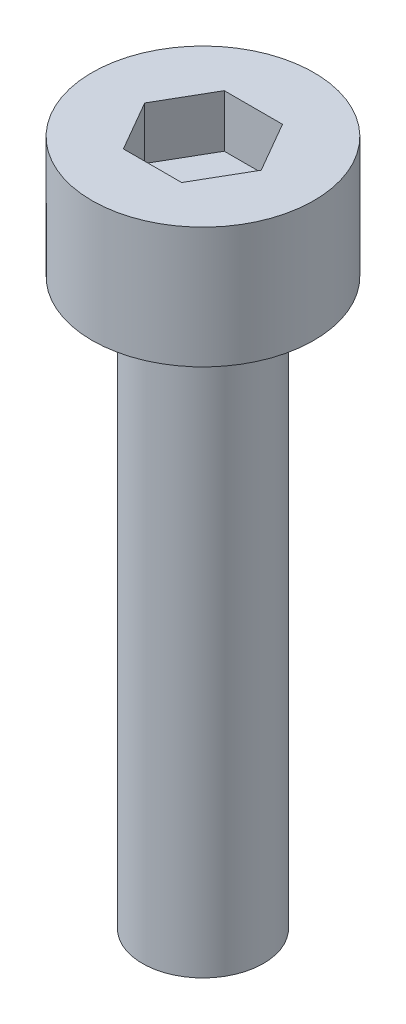
ISO-10303-21;
HEADER;
FILE_DESCRIPTION(('STEP AP214'),'2;1');
FILE_NAME('part.step','',(''),(''),'','','');
FILE_SCHEMA(('AUTOMOTIVE_DESIGN { 1 0 10303 214 1 1 1 1 }'));
ENDSEC;
DATA;
#1=APPLICATION_CONTEXT('core data for automotive mechanical design processes');
#2=APPLICATION_PROTOCOL_DEFINITION('international standard','automotive_design',2000,#1);
#3=PRODUCT_CONTEXT('',#1,'mechanical');
#4=PRODUCT('Part','Part','',(#3));
#5=PRODUCT_RELATED_PRODUCT_CATEGORY('part','',(#4));
#6=PRODUCT_DEFINITION_FORMATION('','',#4);
#7=PRODUCT_DEFINITION_CONTEXT('part definition',#1,'design');
#8=PRODUCT_DEFINITION('design','',#6,#7);
#9=PRODUCT_DEFINITION_SHAPE('','',#8);
#10=(LENGTH_UNIT() NAMED_UNIT(*) SI_UNIT(.MILLI.,.METRE.));
#11=(NAMED_UNIT(*) PLANE_ANGLE_UNIT() SI_UNIT($,.RADIAN.));
#12=(NAMED_UNIT(*) SI_UNIT($,.STERADIAN.) SOLID_ANGLE_UNIT());
#13=UNCERTAINTY_MEASURE_WITH_UNIT(LENGTH_MEASURE(1.E-05),#10,'distance_accuracy_value','');
#14=(GEOMETRIC_REPRESENTATION_CONTEXT(3) GLOBAL_UNCERTAINTY_ASSIGNED_CONTEXT((#13)) GLOBAL_UNIT_ASSIGNED_CONTEXT((#10,
#11,#12)) REPRESENTATION_CONTEXT('',''));
#15=CARTESIAN_POINT('',(0.,0.,0.));
#16=DIRECTION('',(0.,0.,1.));
#17=DIRECTION('',(1.,0.,0.));
#18=AXIS2_PLACEMENT_3D('',#15,#16,#17);
#19=CARTESIAN_POINT('',(0.,3.,0.));
#20=DIRECTION('',(0.,-1.,0.));
#21=DIRECTION('',(0.,0.,-1.));
#22=AXIS2_PLACEMENT_3D('',#19,#20,#21);
#23=CYLINDRICAL_SURFACE('',#22,2.75);
#24=CARTESIAN_POINT('',(0.,3.,0.));
#25=DIRECTION('',(0.,1.,0.));
#26=DIRECTION('',(0.,0.,1.));
#27=AXIS2_PLACEMENT_3D('',#24,#25,#26);
#28=CIRCLE('',#27,2.75);
#29=CARTESIAN_POINT('',(0.,3.,2.75));
#30=VERTEX_POINT('',#29);
#31=EDGE_CURVE('E45',#30,#30,#28,.T.);
#32=ORIENTED_EDGE('',*,*,#31,.F.);
#33=EDGE_LOOP('',(#32));
#34=FACE_BOUND('',#33,.T.);
#35=CARTESIAN_POINT('',(0.,0.,0.));
#36=DIRECTION('',(0.,1.,0.));
#37=DIRECTION('',(0.,0.,1.));
#38=AXIS2_PLACEMENT_3D('',#35,#36,#37);
#39=CIRCLE('',#38,2.75);
#40=CARTESIAN_POINT('',(0.,0.,2.75));
#41=VERTEX_POINT('',#40);
#42=EDGE_CURVE('E40',#41,#41,#39,.T.);
#43=ORIENTED_EDGE('',*,*,#42,.T.);
#44=EDGE_LOOP('',(#43));
#45=FACE_BOUND('',#44,.T.);
#46=ADVANCED_FACE('F37',(#34,#45),#23,.T.);
#47=CARTESIAN_POINT('',(0.,3.,0.));
#48=DIRECTION('',(0.,1.,0.));
#49=DIRECTION('',(0.,0.,1.));
#50=AXIS2_PLACEMENT_3D('',#47,#48,#49);
#51=PLANE('',#50);
#52=DIRECTION('',(0.5,0.,-0.866025403784439));
#53=VECTOR('',#52,1.);
#54=CARTESIAN_POINT('',(0.721687836487032,3.,1.25));
#55=LINE('',#54,#53);
#56=CARTESIAN_POINT('',(0.721687836487032,3.,1.25));
#57=VERTEX_POINT('',#56);
#58=CARTESIAN_POINT('',(1.44337567297406,3.,0.));
#59=VERTEX_POINT('',#58);
#60=EDGE_CURVE('E53',#57,#59,#55,.T.);
#61=ORIENTED_EDGE('',*,*,#60,.F.);
#62=DIRECTION('',(1.,0.,0.));
#63=VECTOR('',#62,1.);
#64=CARTESIAN_POINT('',(-0.721687836487033,3.,1.25));
#65=LINE('',#64,#63);
#66=CARTESIAN_POINT('',(-0.721687836487033,3.,1.25));
#67=VERTEX_POINT('',#66);
#68=EDGE_CURVE('E137',#67,#57,#65,.T.);
#69=ORIENTED_EDGE('',*,*,#68,.F.);
#70=DIRECTION('',(0.5,0.,0.866025403784439));
#71=VECTOR('',#70,1.);
#72=CARTESIAN_POINT('',(-1.44337567297407,3.,0.));
#73=LINE('',#72,#71);
#74=CARTESIAN_POINT('',(-1.44337567297407,3.,0.));
#75=VERTEX_POINT('',#74);
#76=EDGE_CURVE('E135',#75,#67,#73,.T.);
#77=ORIENTED_EDGE('',*,*,#76,.F.);
#78=DIRECTION('',(-0.5,0.,0.866025403784438));
#79=VECTOR('',#78,1.);
#80=CARTESIAN_POINT('',(-0.721687836487033,3.,-1.25));
#81=LINE('',#80,#79);
#82=CARTESIAN_POINT('',(-0.721687836487033,3.,-1.25));
#83=VERTEX_POINT('',#82);
#84=EDGE_CURVE('E101',#83,#75,#81,.T.);
#85=ORIENTED_EDGE('',*,*,#84,.F.);
#86=DIRECTION('',(-1.,0.,0.));
#87=VECTOR('',#86,1.);
#88=CARTESIAN_POINT('',(0.721687836487032,3.,-1.25));
#89=LINE('',#88,#87);
#90=CARTESIAN_POINT('',(0.721687836487032,3.,-1.25));
#91=VERTEX_POINT('',#90);
#92=EDGE_CURVE('E131',#91,#83,#89,.T.);
#93=ORIENTED_EDGE('',*,*,#92,.F.);
#94=DIRECTION('',(-0.5,0.,-0.866025403784439));
#95=VECTOR('',#94,1.);
#96=CARTESIAN_POINT('',(1.44337567297406,3.,0.));
#97=LINE('',#96,#95);
#98=EDGE_CURVE('E127',#59,#91,#97,.T.);
#99=ORIENTED_EDGE('',*,*,#98,.F.);
#100=EDGE_LOOP('',(#61,#69,#77,#85,#93,#99));
#101=FACE_BOUND('',#100,.T.);
#102=ORIENTED_EDGE('',*,*,#31,.T.);
#103=EDGE_LOOP('',(#102));
#104=FACE_BOUND('',#103,.T.);
#105=ADVANCED_FACE('F155',(#101,#104),#51,.T.);
#106=CARTESIAN_POINT('',(0.,0.,0.));
#107=DIRECTION('',(0.,1.,0.));
#108=DIRECTION('',(0.,0.,1.));
#109=AXIS2_PLACEMENT_3D('',#106,#107,#108);
#110=PLANE('',#109);
#111=CARTESIAN_POINT('',(0.,0.,0.));
#112=DIRECTION('',(0.,-1.,0.));
#113=DIRECTION('',(0.,0.,-1.));
#114=AXIS2_PLACEMENT_3D('',#111,#112,#113);
#115=CIRCLE('',#114,1.5);
#116=CARTESIAN_POINT('',(0.,0.,-1.5));
#117=VERTEX_POINT('',#116);
#118=EDGE_CURVE('E11',#117,#117,#115,.T.);
#119=ORIENTED_EDGE('',*,*,#118,.F.);
#120=EDGE_LOOP('',(#119));
#121=FACE_BOUND('',#120,.T.);
#122=ORIENTED_EDGE('',*,*,#42,.F.);
#123=EDGE_LOOP('',(#122));
#124=FACE_BOUND('',#123,.T.);
#125=ADVANCED_FACE('F152',(#121,#124),#110,.F.);
#126=CARTESIAN_POINT('',(0.721687836487032,1.7,1.25));
#127=DIRECTION('',(0.866025403784439,0.,0.5));
#128=DIRECTION('',(0.5,0.,-0.866025403784439));
#129=AXIS2_PLACEMENT_3D('',#126,#127,#128);
#130=PLANE('',#129);
#131=ORIENTED_EDGE('',*,*,#60,.T.);
#132=DIRECTION('',(0.,1.,0.));
#133=VECTOR('',#132,1.);
#134=CARTESIAN_POINT('',(1.44337567297406,1.7,0.));
#135=LINE('',#134,#133);
#136=CARTESIAN_POINT('',(1.44337567297406,1.7,0.));
#137=VERTEX_POINT('',#136);
#138=EDGE_CURVE('E83',#137,#59,#135,.T.);
#139=ORIENTED_EDGE('',*,*,#138,.F.);
#140=DIRECTION('',(0.5,0.,-0.866025403784439));
#141=VECTOR('',#140,1.);
#142=CARTESIAN_POINT('',(0.721687836487032,1.7,1.25));
#143=LINE('',#142,#141);
#144=CARTESIAN_POINT('',(0.721687836487032,1.7,1.25));
#145=VERTEX_POINT('',#144);
#146=EDGE_CURVE('E139',#145,#137,#143,.T.);
#147=ORIENTED_EDGE('',*,*,#146,.F.);
#148=DIRECTION('',(0.,1.,0.));
#149=VECTOR('',#148,1.);
#150=CARTESIAN_POINT('',(0.721687836487032,1.7,1.25));
#151=LINE('',#150,#149);
#152=EDGE_CURVE('E61',#145,#57,#151,.T.);
#153=ORIENTED_EDGE('',*,*,#152,.T.);
#154=EDGE_LOOP('',(#131,#139,#147,#153));
#155=FACE_BOUND('',#154,.T.);
#156=ADVANCED_FACE('F154',(#155),#130,.F.);
#157=CARTESIAN_POINT('',(-0.721687836487033,1.7,1.25));
#158=DIRECTION('',(0.,0.,1.));
#159=DIRECTION('',(1.,0.,0.));
#160=AXIS2_PLACEMENT_3D('',#157,#158,#159);
#161=PLANE('',#160);
#162=ORIENTED_EDGE('',*,*,#68,.T.);
#163=ORIENTED_EDGE('',*,*,#152,.F.);
#164=DIRECTION('',(1.,0.,0.));
#165=VECTOR('',#164,1.);
#166=CARTESIAN_POINT('',(-0.721687836487033,1.7,1.25));
#167=LINE('',#166,#165);
#168=CARTESIAN_POINT('',(-0.721687836487033,1.7,1.25));
#169=VERTEX_POINT('',#168);
#170=EDGE_CURVE('E113',#169,#145,#167,.T.);
#171=ORIENTED_EDGE('',*,*,#170,.F.);
#172=DIRECTION('',(0.,1.,0.));
#173=VECTOR('',#172,1.);
#174=CARTESIAN_POINT('',(-0.721687836487033,1.7,1.25));
#175=LINE('',#174,#173);
#176=EDGE_CURVE('E105',#169,#67,#175,.T.);
#177=ORIENTED_EDGE('',*,*,#176,.T.);
#178=EDGE_LOOP('',(#162,#163,#171,#177));
#179=FACE_BOUND('',#178,.T.);
#180=ADVANCED_FACE('F161',(#179),#161,.F.);
#181=CARTESIAN_POINT('',(-1.44337567297407,1.7,0.));
#182=DIRECTION('',(-0.866025403784439,0.,0.5));
#183=DIRECTION('',(0.5,0.,0.866025403784439));
#184=AXIS2_PLACEMENT_3D('',#181,#182,#183);
#185=PLANE('',#184);
#186=ORIENTED_EDGE('',*,*,#76,.T.);
#187=ORIENTED_EDGE('',*,*,#176,.F.);
#188=DIRECTION('',(0.5,0.,0.866025403784439));
#189=VECTOR('',#188,1.);
#190=CARTESIAN_POINT('',(-1.44337567297407,1.7,0.));
#191=LINE('',#190,#189);
#192=CARTESIAN_POINT('',(-1.44337567297407,1.7,0.));
#193=VERTEX_POINT('',#192);
#194=EDGE_CURVE('E109',#193,#169,#191,.T.);
#195=ORIENTED_EDGE('',*,*,#194,.F.);
#196=DIRECTION('',(0.,1.,0.));
#197=VECTOR('',#196,1.);
#198=CARTESIAN_POINT('',(-1.44337567297407,1.7,0.));
#199=LINE('',#198,#197);
#200=EDGE_CURVE('E94',#193,#75,#199,.T.);
#201=ORIENTED_EDGE('',*,*,#200,.T.);
#202=EDGE_LOOP('',(#186,#187,#195,#201));
#203=FACE_BOUND('',#202,.T.);
#204=ADVANCED_FACE('F110',(#203),#185,.F.);
#205=CARTESIAN_POINT('',(-0.721687836487033,1.7,-1.25));
#206=DIRECTION('',(-0.866025403784439,0.,-0.5));
#207=DIRECTION('',(-0.5,0.,0.866025403784439));
#208=AXIS2_PLACEMENT_3D('',#205,#206,#207);
#209=PLANE('',#208);
#210=ORIENTED_EDGE('',*,*,#84,.T.);
#211=ORIENTED_EDGE('',*,*,#200,.F.);
#212=DIRECTION('',(-0.5,0.,0.866025403784438));
#213=VECTOR('',#212,1.);
#214=CARTESIAN_POINT('',(-0.721687836487033,1.7,-1.25));
#215=LINE('',#214,#213);
#216=CARTESIAN_POINT('',(-0.721687836487033,1.7,-1.25));
#217=VERTEX_POINT('',#216);
#218=EDGE_CURVE('E98',#217,#193,#215,.T.);
#219=ORIENTED_EDGE('',*,*,#218,.F.);
#220=DIRECTION('',(0.,1.,0.));
#221=VECTOR('',#220,1.);
#222=CARTESIAN_POINT('',(-0.721687836487033,1.7,-1.25));
#223=LINE('',#222,#221);
#224=EDGE_CURVE('E106',#217,#83,#223,.T.);
#225=ORIENTED_EDGE('',*,*,#224,.T.);
#226=EDGE_LOOP('',(#210,#211,#219,#225));
#227=FACE_BOUND('',#226,.T.);
#228=ADVANCED_FACE('F96',(#227),#209,.F.);
#229=CARTESIAN_POINT('',(0.721687836487032,1.7,-1.25));
#230=DIRECTION('',(0.,0.,-1.));
#231=DIRECTION('',(-1.,0.,0.));
#232=AXIS2_PLACEMENT_3D('',#229,#230,#231);
#233=PLANE('',#232);
#234=ORIENTED_EDGE('',*,*,#92,.T.);
#235=ORIENTED_EDGE('',*,*,#224,.F.);
#236=DIRECTION('',(-1.,0.,0.));
#237=VECTOR('',#236,1.);
#238=CARTESIAN_POINT('',(0.721687836487032,1.7,-1.25));
#239=LINE('',#238,#237);
#240=CARTESIAN_POINT('',(0.721687836487032,1.7,-1.25));
#241=VERTEX_POINT('',#240);
#242=EDGE_CURVE('E119',#241,#217,#239,.T.);
#243=ORIENTED_EDGE('',*,*,#242,.F.);
#244=DIRECTION('',(0.,1.,0.));
#245=VECTOR('',#244,1.);
#246=CARTESIAN_POINT('',(0.721687836487032,1.7,-1.25));
#247=LINE('',#246,#245);
#248=EDGE_CURVE('E143',#241,#91,#247,.T.);
#249=ORIENTED_EDGE('',*,*,#248,.T.);
#250=EDGE_LOOP('',(#234,#235,#243,#249));
#251=FACE_BOUND('',#250,.T.);
#252=ADVANCED_FACE('F206',(#251),#233,.F.);
#253=CARTESIAN_POINT('',(1.44337567297406,1.7,0.));
#254=DIRECTION('',(0.866025403784439,0.,-0.5));
#255=DIRECTION('',(-0.5,0.,-0.866025403784439));
#256=AXIS2_PLACEMENT_3D('',#253,#254,#255);
#257=PLANE('',#256);
#258=ORIENTED_EDGE('',*,*,#98,.T.);
#259=ORIENTED_EDGE('',*,*,#248,.F.);
#260=DIRECTION('',(-0.5,0.,-0.866025403784439));
#261=VECTOR('',#260,1.);
#262=CARTESIAN_POINT('',(1.44337567297406,1.7,0.));
#263=LINE('',#262,#261);
#264=EDGE_CURVE('E121',#137,#241,#263,.T.);
#265=ORIENTED_EDGE('',*,*,#264,.F.);
#266=ORIENTED_EDGE('',*,*,#138,.T.);
#267=EDGE_LOOP('',(#258,#259,#265,#266));
#268=FACE_BOUND('',#267,.T.);
#269=ADVANCED_FACE('F215',(#268),#257,.F.);
#270=CARTESIAN_POINT('',(0.,1.7,0.));
#271=DIRECTION('',(0.,1.,0.));
#272=DIRECTION('',(0.,0.,1.));
#273=AXIS2_PLACEMENT_3D('',#270,#271,#272);
#274=PLANE('',#273);
#275=ORIENTED_EDGE('',*,*,#146,.T.);
#276=ORIENTED_EDGE('',*,*,#264,.T.);
#277=ORIENTED_EDGE('',*,*,#242,.T.);
#278=ORIENTED_EDGE('',*,*,#218,.T.);
#279=ORIENTED_EDGE('',*,*,#194,.T.);
#280=ORIENTED_EDGE('',*,*,#170,.T.);
#281=EDGE_LOOP('',(#275,#276,#277,#278,#279,#280));
#282=FACE_BOUND('',#281,.T.);
#283=ADVANCED_FACE('F116',(#282),#274,.T.);
#284=CARTESIAN_POINT('',(0.,-14.,0.));
#285=DIRECTION('',(0.,1.,0.));
#286=DIRECTION('',(0.,0.,1.));
#287=AXIS2_PLACEMENT_3D('',#284,#285,#286);
#288=CYLINDRICAL_SURFACE('',#287,1.5);
#289=CARTESIAN_POINT('',(0.,-14.,0.));
#290=DIRECTION('',(0.,-1.,0.));
#291=DIRECTION('',(0.,0.,-1.));
#292=AXIS2_PLACEMENT_3D('',#289,#290,#291);
#293=CIRCLE('',#292,1.5);
#294=CARTESIAN_POINT('',(0.,-14.,-1.5));
#295=VERTEX_POINT('',#294);
#296=EDGE_CURVE('E128',#295,#295,#293,.T.);
#297=ORIENTED_EDGE('',*,*,#296,.F.);
#298=EDGE_LOOP('',(#297));
#299=FACE_BOUND('',#298,.T.);
#300=ORIENTED_EDGE('',*,*,#118,.T.);
#301=EDGE_LOOP('',(#300));
#302=FACE_BOUND('',#301,.T.);
#303=ADVANCED_FACE('F233',(#299,#302),#288,.T.);
#304=CARTESIAN_POINT('',(0.,-14.,0.));
#305=DIRECTION('',(0.,-1.,0.));
#306=DIRECTION('',(0.,0.,-1.));
#307=AXIS2_PLACEMENT_3D('',#304,#305,#306);
#308=PLANE('',#307);
#309=ORIENTED_EDGE('',*,*,#296,.T.);
#310=EDGE_LOOP('',(#309));
#311=FACE_BOUND('',#310,.T.);
#312=ADVANCED_FACE('F247',(#311),#308,.T.);
#313=CLOSED_SHELL('',(#46,#105,#125,#156,#180,#204,#228,#252,#269,#283,#303,#312));
#314=MANIFOLD_SOLID_BREP('B2',#313);
#315=ADVANCED_BREP_SHAPE_REPRESENTATION('',(#18,#314),#14);
#316=SHAPE_DEFINITION_REPRESENTATION(#9,#315);
ENDSEC;
END-ISO-10303-21;
